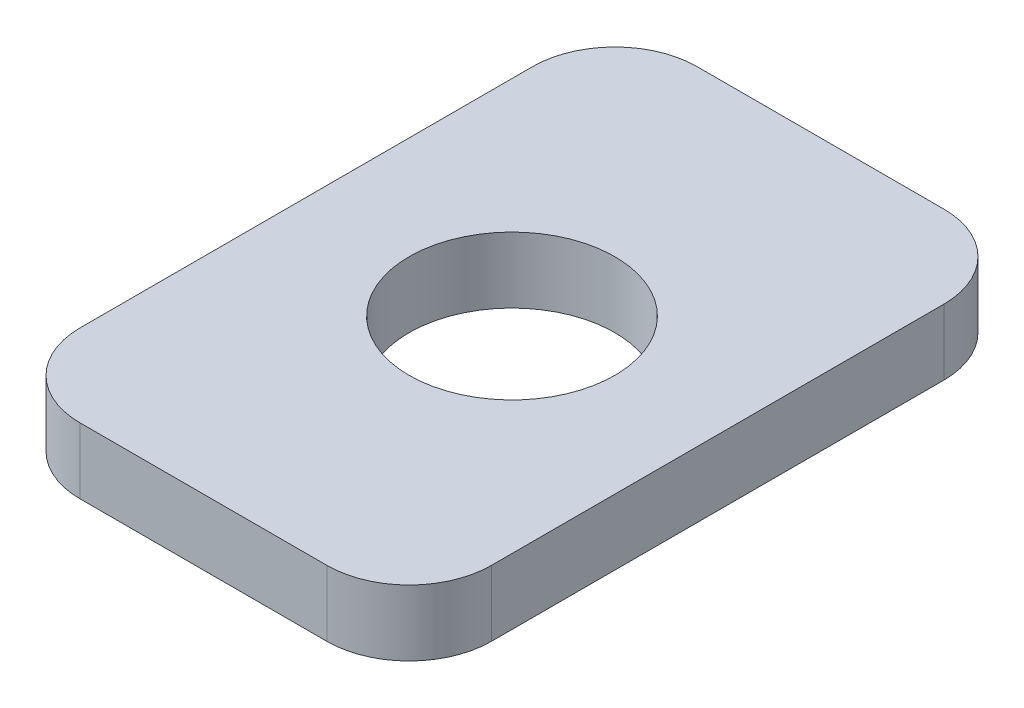
ISO-10303-21;
HEADER;
FILE_DESCRIPTION(('STEP AP214'),'2;1');
FILE_NAME('part.step','',(''),(''),'','','');
FILE_SCHEMA(('AUTOMOTIVE_DESIGN { 1 0 10303 214 1 1 1 1 }'));
ENDSEC;
DATA;
#1=APPLICATION_CONTEXT('core data for automotive mechanical design processes');
#2=APPLICATION_PROTOCOL_DEFINITION('international standard','automotive_design',2000,#1);
#3=PRODUCT_CONTEXT('',#1,'mechanical');
#4=PRODUCT('Part','Part','',(#3));
#5=PRODUCT_RELATED_PRODUCT_CATEGORY('part','',(#4));
#6=PRODUCT_DEFINITION_FORMATION('','',#4);
#7=PRODUCT_DEFINITION_CONTEXT('part definition',#1,'design');
#8=PRODUCT_DEFINITION('design','',#6,#7);
#9=PRODUCT_DEFINITION_SHAPE('','',#8);
#10=(LENGTH_UNIT() NAMED_UNIT(*) SI_UNIT(.MILLI.,.METRE.));
#11=(NAMED_UNIT(*) PLANE_ANGLE_UNIT() SI_UNIT($,.RADIAN.));
#12=(NAMED_UNIT(*) SI_UNIT($,.STERADIAN.) SOLID_ANGLE_UNIT());
#13=UNCERTAINTY_MEASURE_WITH_UNIT(LENGTH_MEASURE(1.E-05),#10,'distance_accuracy_value','');
#14=(GEOMETRIC_REPRESENTATION_CONTEXT(3) GLOBAL_UNCERTAINTY_ASSIGNED_CONTEXT((#13)) GLOBAL_UNIT_ASSIGNED_CONTEXT((#10,
#11,#12)) REPRESENTATION_CONTEXT('',''));
#15=CARTESIAN_POINT('',(0.,0.,0.));
#16=DIRECTION('',(0.,0.,1.));
#17=DIRECTION('',(1.,0.,0.));
#18=AXIS2_PLACEMENT_3D('',#15,#16,#17);
#19=CARTESIAN_POINT('',(0.,1.6,0.));
#20=DIRECTION('',(0.,1.,0.));
#21=DIRECTION('',(0.,0.,1.));
#22=AXIS2_PLACEMENT_3D('',#19,#20,#21);
#23=PLANE('',#22);
#24=CARTESIAN_POINT('',(0.,1.6,0.));
#25=DIRECTION('',(0.,1.,0.));
#26=DIRECTION('',(0.,0.,1.));
#27=AXIS2_PLACEMENT_3D('',#24,#25,#26);
#28=CIRCLE('',#27,2.5);
#29=CARTESIAN_POINT('',(0.,1.6,2.5));
#30=VERTEX_POINT('',#29);
#31=EDGE_CURVE('E158',#30,#30,#28,.F.);
#32=ORIENTED_EDGE('',*,*,#31,.T.);
#33=EDGE_LOOP('',(#32));
#34=FACE_BOUND('',#33,.T.);
#35=DIRECTION('',(-1.,0.,0.));
#36=VECTOR('',#35,1.);
#37=CARTESIAN_POINT('',(5.,1.6,-7.5));
#38=LINE('',#37,#36);
#39=CARTESIAN_POINT('',(-3.,1.6,-7.5));
#40=VERTEX_POINT('',#39);
#41=CARTESIAN_POINT('',(3.,1.6,-7.5));
#42=VERTEX_POINT('',#41);
#43=EDGE_CURVE('E112',#40,#42,#38,.F.);
#44=ORIENTED_EDGE('',*,*,#43,.F.);
#45=CARTESIAN_POINT('',(-3.,1.6,-5.5));
#46=DIRECTION('',(0.,-1.,0.));
#47=DIRECTION('',(0.,0.,-1.));
#48=AXIS2_PLACEMENT_3D('',#45,#46,#47);
#49=CIRCLE('',#48,2.);
#50=CARTESIAN_POINT('',(-5.,1.6,-5.5));
#51=VERTEX_POINT('',#50);
#52=EDGE_CURVE('E20',#51,#40,#49,.T.);
#53=ORIENTED_EDGE('',*,*,#52,.F.);
#54=DIRECTION('',(0.,0.,1.));
#55=VECTOR('',#54,1.);
#56=CARTESIAN_POINT('',(-5.,1.6,-7.5));
#57=LINE('',#56,#55);
#58=CARTESIAN_POINT('',(-5.,1.6,5.5));
#59=VERTEX_POINT('',#58);
#60=EDGE_CURVE('E97',#59,#51,#57,.F.);
#61=ORIENTED_EDGE('',*,*,#60,.F.);
#62=CARTESIAN_POINT('',(-3.,1.6,5.5));
#63=DIRECTION('',(0.,-1.,0.));
#64=DIRECTION('',(0.,0.,-1.));
#65=AXIS2_PLACEMENT_3D('',#62,#63,#64);
#66=CIRCLE('',#65,2.);
#67=CARTESIAN_POINT('',(-3.,1.6,7.5));
#68=VERTEX_POINT('',#67);
#69=EDGE_CURVE('E121',#68,#59,#66,.T.);
#70=ORIENTED_EDGE('',*,*,#69,.F.);
#71=DIRECTION('',(1.,0.,0.));
#72=VECTOR('',#71,1.);
#73=CARTESIAN_POINT('',(-5.,1.6,7.5));
#74=LINE('',#73,#72);
#75=CARTESIAN_POINT('',(3.,1.6,7.5));
#76=VERTEX_POINT('',#75);
#77=EDGE_CURVE('E137',#76,#68,#74,.F.);
#78=ORIENTED_EDGE('',*,*,#77,.F.);
#79=CARTESIAN_POINT('',(3.,1.6,5.5));
#80=DIRECTION('',(0.,-1.,0.));
#81=DIRECTION('',(0.,0.,-1.));
#82=AXIS2_PLACEMENT_3D('',#79,#80,#81);
#83=CIRCLE('',#82,2.);
#84=CARTESIAN_POINT('',(5.,1.6,5.5));
#85=VERTEX_POINT('',#84);
#86=EDGE_CURVE('E166',#85,#76,#83,.T.);
#87=ORIENTED_EDGE('',*,*,#86,.F.);
#88=DIRECTION('',(0.,0.,-1.));
#89=VECTOR('',#88,1.);
#90=CARTESIAN_POINT('',(5.,1.6,7.5));
#91=LINE('',#90,#89);
#92=CARTESIAN_POINT('',(5.,1.6,-5.5));
#93=VERTEX_POINT('',#92);
#94=EDGE_CURVE('E132',#93,#85,#91,.F.);
#95=ORIENTED_EDGE('',*,*,#94,.F.);
#96=CARTESIAN_POINT('',(3.,1.6,-5.5));
#97=DIRECTION('',(0.,-1.,0.));
#98=DIRECTION('',(0.,0.,-1.));
#99=AXIS2_PLACEMENT_3D('',#96,#97,#98);
#100=CIRCLE('',#99,2.);
#101=EDGE_CURVE('E163',#42,#93,#100,.T.);
#102=ORIENTED_EDGE('',*,*,#101,.F.);
#103=EDGE_LOOP('',(#44,#53,#61,#70,#78,#87,#95,#102));
#104=FACE_BOUND('',#103,.T.);
#105=ADVANCED_FACE('F17',(#34,#104),#23,.T.);
#106=CARTESIAN_POINT('',(-3.,4.16672,-5.5));
#107=DIRECTION('',(0.,-1.,0.));
#108=DIRECTION('',(0.,0.,-1.));
#109=AXIS2_PLACEMENT_3D('',#106,#107,#108);
#110=CYLINDRICAL_SURFACE('',#109,2.);
#111=DIRECTION('',(0.,1.,0.));
#112=VECTOR('',#111,1.);
#113=CARTESIAN_POINT('',(-3.,0.,-7.5));
#114=LINE('',#113,#112);
#115=CARTESIAN_POINT('',(-3.,0.,-7.5));
#116=VERTEX_POINT('',#115);
#117=EDGE_CURVE('E162',#116,#40,#114,.T.);
#118=ORIENTED_EDGE('',*,*,#117,.F.);
#119=CARTESIAN_POINT('',(-3.,0.,-5.5));
#120=DIRECTION('',(0.,-1.,0.));
#121=DIRECTION('',(0.,0.,-1.));
#122=AXIS2_PLACEMENT_3D('',#119,#120,#121);
#123=CIRCLE('',#122,2.);
#124=CARTESIAN_POINT('',(-5.,0.,-5.5));
#125=VERTEX_POINT('',#124);
#126=EDGE_CURVE('E119',#116,#125,#123,.F.);
#127=ORIENTED_EDGE('',*,*,#126,.T.);
#128=DIRECTION('',(0.,1.,0.));
#129=VECTOR('',#128,1.);
#130=CARTESIAN_POINT('',(-5.,0.,-5.5));
#131=LINE('',#130,#129);
#132=EDGE_CURVE('E102',#51,#125,#131,.F.);
#133=ORIENTED_EDGE('',*,*,#132,.F.);
#134=ORIENTED_EDGE('',*,*,#52,.T.);
#135=EDGE_LOOP('',(#118,#127,#133,#134));
#136=FACE_BOUND('',#135,.T.);
#137=ADVANCED_FACE('F118',(#136),#110,.T.);
#138=CARTESIAN_POINT('',(-5.,0.,-7.5));
#139=DIRECTION('',(-1.,0.,0.));
#140=DIRECTION('',(0.,0.,1.));
#141=AXIS2_PLACEMENT_3D('',#138,#139,#140);
#142=PLANE('',#141);
#143=ORIENTED_EDGE('',*,*,#60,.T.);
#144=ORIENTED_EDGE('',*,*,#132,.T.);
#145=DIRECTION('',(0.,0.,1.));
#146=VECTOR('',#145,1.);
#147=CARTESIAN_POINT('',(-5.,0.,0.));
#148=LINE('',#147,#146);
#149=CARTESIAN_POINT('',(-5.,0.,5.5));
#150=VERTEX_POINT('',#149);
#151=EDGE_CURVE('E155',#125,#150,#148,.T.);
#152=ORIENTED_EDGE('',*,*,#151,.T.);
#153=DIRECTION('',(0.,-1.,0.));
#154=VECTOR('',#153,1.);
#155=CARTESIAN_POINT('',(-5.,4.16672,5.5));
#156=LINE('',#155,#154);
#157=EDGE_CURVE('E104',#59,#150,#156,.T.);
#158=ORIENTED_EDGE('',*,*,#157,.F.);
#159=EDGE_LOOP('',(#143,#144,#152,#158));
#160=FACE_BOUND('',#159,.T.);
#161=ADVANCED_FACE('F99',(#160),#142,.T.);
#162=CARTESIAN_POINT('',(-3.,4.16672,5.5));
#163=DIRECTION('',(0.,-1.,0.));
#164=DIRECTION('',(0.,0.,-1.));
#165=AXIS2_PLACEMENT_3D('',#162,#163,#164);
#166=CYLINDRICAL_SURFACE('',#165,2.);
#167=ORIENTED_EDGE('',*,*,#157,.T.);
#168=CARTESIAN_POINT('',(-3.,0.,5.5));
#169=DIRECTION('',(0.,-1.,0.));
#170=DIRECTION('',(0.,0.,-1.));
#171=AXIS2_PLACEMENT_3D('',#168,#169,#170);
#172=CIRCLE('',#171,2.);
#173=CARTESIAN_POINT('',(-3.,0.,7.5));
#174=VERTEX_POINT('',#173);
#175=EDGE_CURVE('E151',#150,#174,#172,.F.);
#176=ORIENTED_EDGE('',*,*,#175,.T.);
#177=DIRECTION('',(0.,1.,0.));
#178=VECTOR('',#177,1.);
#179=CARTESIAN_POINT('',(-3.,0.,7.5));
#180=LINE('',#179,#178);
#181=EDGE_CURVE('E139',#68,#174,#180,.F.);
#182=ORIENTED_EDGE('',*,*,#181,.F.);
#183=ORIENTED_EDGE('',*,*,#69,.T.);
#184=EDGE_LOOP('',(#167,#176,#182,#183));
#185=FACE_BOUND('',#184,.T.);
#186=ADVANCED_FACE('F212',(#185),#166,.T.);
#187=CARTESIAN_POINT('',(-5.,0.,7.5));
#188=DIRECTION('',(0.,0.,1.));
#189=DIRECTION('',(1.,0.,0.));
#190=AXIS2_PLACEMENT_3D('',#187,#188,#189);
#191=PLANE('',#190);
#192=DIRECTION('',(1.,0.,0.));
#193=VECTOR('',#192,1.);
#194=CARTESIAN_POINT('',(0.,0.,7.5));
#195=LINE('',#194,#193);
#196=CARTESIAN_POINT('',(3.,0.,7.5));
#197=VERTEX_POINT('',#196);
#198=EDGE_CURVE('E150',#174,#197,#195,.T.);
#199=ORIENTED_EDGE('',*,*,#198,.T.);
#200=DIRECTION('',(0.,-1.,0.));
#201=VECTOR('',#200,1.);
#202=CARTESIAN_POINT('',(3.,4.16672,7.5));
#203=LINE('',#202,#201);
#204=EDGE_CURVE('E136',#76,#197,#203,.T.);
#205=ORIENTED_EDGE('',*,*,#204,.F.);
#206=ORIENTED_EDGE('',*,*,#77,.T.);
#207=ORIENTED_EDGE('',*,*,#181,.T.);
#208=EDGE_LOOP('',(#199,#205,#206,#207));
#209=FACE_BOUND('',#208,.T.);
#210=ADVANCED_FACE('F209',(#209),#191,.T.);
#211=CARTESIAN_POINT('',(3.,4.16672,5.5));
#212=DIRECTION('',(0.,-1.,0.));
#213=DIRECTION('',(0.,0.,-1.));
#214=AXIS2_PLACEMENT_3D('',#211,#212,#213);
#215=CYLINDRICAL_SURFACE('',#214,2.);
#216=ORIENTED_EDGE('',*,*,#204,.T.);
#217=CARTESIAN_POINT('',(3.,0.,5.5));
#218=DIRECTION('',(0.,-1.,0.));
#219=DIRECTION('',(0.,0.,-1.));
#220=AXIS2_PLACEMENT_3D('',#217,#218,#219);
#221=CIRCLE('',#220,2.);
#222=CARTESIAN_POINT('',(5.,0.,5.5));
#223=VERTEX_POINT('',#222);
#224=EDGE_CURVE('E146',#197,#223,#221,.F.);
#225=ORIENTED_EDGE('',*,*,#224,.T.);
#226=DIRECTION('',(0.,1.,0.));
#227=VECTOR('',#226,1.);
#228=CARTESIAN_POINT('',(5.,0.,5.5));
#229=LINE('',#228,#227);
#230=EDGE_CURVE('E135',#85,#223,#229,.F.);
#231=ORIENTED_EDGE('',*,*,#230,.F.);
#232=ORIENTED_EDGE('',*,*,#86,.T.);
#233=EDGE_LOOP('',(#216,#225,#231,#232));
#234=FACE_BOUND('',#233,.T.);
#235=ADVANCED_FACE('F207',(#234),#215,.T.);
#236=CARTESIAN_POINT('',(5.,0.,7.5));
#237=DIRECTION('',(1.,0.,0.));
#238=DIRECTION('',(0.,0.,-1.));
#239=AXIS2_PLACEMENT_3D('',#236,#237,#238);
#240=PLANE('',#239);
#241=DIRECTION('',(0.,0.,1.));
#242=VECTOR('',#241,1.);
#243=CARTESIAN_POINT('',(5.,0.,0.));
#244=LINE('',#243,#242);
#245=CARTESIAN_POINT('',(5.,0.,-5.5));
#246=VERTEX_POINT('',#245);
#247=EDGE_CURVE('E145',#223,#246,#244,.F.);
#248=ORIENTED_EDGE('',*,*,#247,.T.);
#249=DIRECTION('',(0.,-1.,0.));
#250=VECTOR('',#249,1.);
#251=CARTESIAN_POINT('',(5.,4.16672,-5.5));
#252=LINE('',#251,#250);
#253=EDGE_CURVE('E131',#93,#246,#252,.T.);
#254=ORIENTED_EDGE('',*,*,#253,.F.);
#255=ORIENTED_EDGE('',*,*,#94,.T.);
#256=ORIENTED_EDGE('',*,*,#230,.T.);
#257=EDGE_LOOP('',(#248,#254,#255,#256));
#258=FACE_BOUND('',#257,.T.);
#259=ADVANCED_FACE('F205',(#258),#240,.T.);
#260=CARTESIAN_POINT('',(3.,4.16672,-5.5));
#261=DIRECTION('',(0.,-1.,0.));
#262=DIRECTION('',(0.,0.,-1.));
#263=AXIS2_PLACEMENT_3D('',#260,#261,#262);
#264=CYLINDRICAL_SURFACE('',#263,2.);
#265=ORIENTED_EDGE('',*,*,#253,.T.);
#266=CARTESIAN_POINT('',(3.,0.,-5.5));
#267=DIRECTION('',(0.,-1.,0.));
#268=DIRECTION('',(0.,0.,-1.));
#269=AXIS2_PLACEMENT_3D('',#266,#267,#268);
#270=CIRCLE('',#269,2.);
#271=CARTESIAN_POINT('',(3.,0.,-7.5));
#272=VERTEX_POINT('',#271);
#273=EDGE_CURVE('E141',#246,#272,#270,.F.);
#274=ORIENTED_EDGE('',*,*,#273,.T.);
#275=DIRECTION('',(0.,1.,0.));
#276=VECTOR('',#275,1.);
#277=CARTESIAN_POINT('',(3.,0.,-7.5));
#278=LINE('',#277,#276);
#279=EDGE_CURVE('E40',#42,#272,#278,.F.);
#280=ORIENTED_EDGE('',*,*,#279,.F.);
#281=ORIENTED_EDGE('',*,*,#101,.T.);
#282=EDGE_LOOP('',(#265,#274,#280,#281));
#283=FACE_BOUND('',#282,.T.);
#284=ADVANCED_FACE('F201',(#283),#264,.T.);
#285=CARTESIAN_POINT('',(5.,0.,-7.5));
#286=DIRECTION('',(0.,0.,-1.));
#287=DIRECTION('',(-1.,0.,0.));
#288=AXIS2_PLACEMENT_3D('',#285,#286,#287);
#289=PLANE('',#288);
#290=DIRECTION('',(1.,0.,0.));
#291=VECTOR('',#290,1.);
#292=CARTESIAN_POINT('',(0.,0.,-7.5));
#293=LINE('',#292,#291);
#294=EDGE_CURVE('E27',#272,#116,#293,.F.);
#295=ORIENTED_EDGE('',*,*,#294,.T.);
#296=ORIENTED_EDGE('',*,*,#117,.T.);
#297=ORIENTED_EDGE('',*,*,#43,.T.);
#298=ORIENTED_EDGE('',*,*,#279,.T.);
#299=EDGE_LOOP('',(#295,#296,#297,#298));
#300=FACE_BOUND('',#299,.T.);
#301=ADVANCED_FACE('F195',(#300),#289,.T.);
#302=CARTESIAN_POINT('',(0.,0.,0.));
#303=DIRECTION('',(0.,1.,0.));
#304=DIRECTION('',(0.,0.,1.));
#305=AXIS2_PLACEMENT_3D('',#302,#303,#304);
#306=CYLINDRICAL_SURFACE('',#305,2.5);
#307=ORIENTED_EDGE('',*,*,#31,.F.);
#308=EDGE_LOOP('',(#307));
#309=FACE_BOUND('',#308,.T.);
#310=CARTESIAN_POINT('',(0.,0.,0.));
#311=DIRECTION('',(0.,1.,0.));
#312=DIRECTION('',(0.,0.,1.));
#313=AXIS2_PLACEMENT_3D('',#310,#311,#312);
#314=CIRCLE('',#313,2.5);
#315=CARTESIAN_POINT('',(0.,0.,2.5));
#316=VERTEX_POINT('',#315);
#317=EDGE_CURVE('E11',#316,#316,#314,.F.);
#318=ORIENTED_EDGE('',*,*,#317,.T.);
#319=EDGE_LOOP('',(#318));
#320=FACE_BOUND('',#319,.T.);
#321=ADVANCED_FACE('F225',(#309,#320),#306,.F.);
#322=CARTESIAN_POINT('',(0.,0.,0.));
#323=DIRECTION('',(0.,1.,0.));
#324=DIRECTION('',(0.,0.,1.));
#325=AXIS2_PLACEMENT_3D('',#322,#323,#324);
#326=PLANE('',#325);
#327=ORIENTED_EDGE('',*,*,#317,.F.);
#328=EDGE_LOOP('',(#327));
#329=FACE_BOUND('',#328,.T.);
#330=ORIENTED_EDGE('',*,*,#273,.F.);
#331=ORIENTED_EDGE('',*,*,#247,.F.);
#332=ORIENTED_EDGE('',*,*,#224,.F.);
#333=ORIENTED_EDGE('',*,*,#198,.F.);
#334=ORIENTED_EDGE('',*,*,#175,.F.);
#335=ORIENTED_EDGE('',*,*,#151,.F.);
#336=ORIENTED_EDGE('',*,*,#126,.F.);
#337=ORIENTED_EDGE('',*,*,#294,.F.);
#338=EDGE_LOOP('',(#330,#331,#332,#333,#334,#335,#336,#337));
#339=FACE_BOUND('',#338,.T.);
#340=ADVANCED_FACE('F198',(#329,#339),#326,.F.);
#341=CLOSED_SHELL('',(#105,#137,#161,#186,#210,#235,#259,#284,#301,#321,#340));
#342=MANIFOLD_SOLID_BREP('B1',#341);
#343=ADVANCED_BREP_SHAPE_REPRESENTATION('',(#18,#342),#14);
#344=SHAPE_DEFINITION_REPRESENTATION(#9,#343);
ENDSEC;
END-ISO-10303-21;
